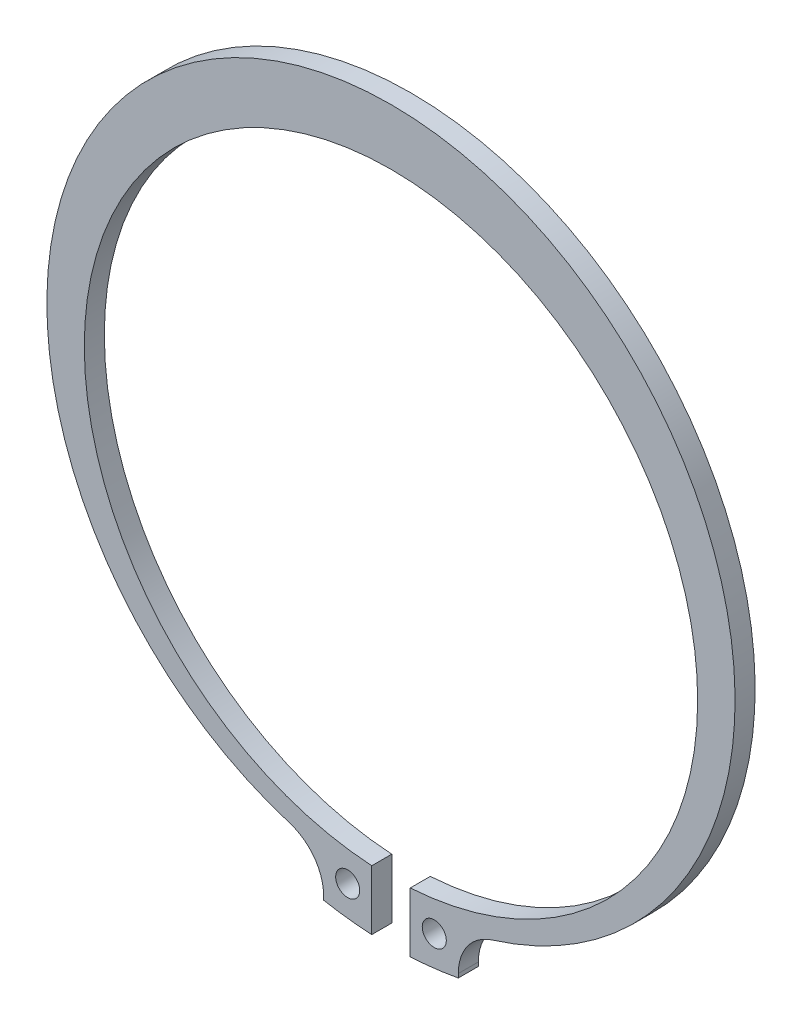
ISO-10303-21;
HEADER;
FILE_DESCRIPTION(('STEP AP214'),'2;1');
FILE_NAME('part.step','',(''),(''),'','','');
FILE_SCHEMA(('AUTOMOTIVE_DESIGN { 1 0 10303 214 1 1 1 1 }'));
ENDSEC;
DATA;
#1=APPLICATION_CONTEXT('core data for automotive mechanical design processes');
#2=APPLICATION_PROTOCOL_DEFINITION('international standard','automotive_design',2000,#1);
#3=PRODUCT_CONTEXT('',#1,'mechanical');
#4=PRODUCT('Part','Part','',(#3));
#5=PRODUCT_RELATED_PRODUCT_CATEGORY('part','',(#4));
#6=PRODUCT_DEFINITION_FORMATION('','',#4);
#7=PRODUCT_DEFINITION_CONTEXT('part definition',#1,'design');
#8=PRODUCT_DEFINITION('design','',#6,#7);
#9=PRODUCT_DEFINITION_SHAPE('','',#8);
#10=(LENGTH_UNIT() NAMED_UNIT(*) SI_UNIT(.MILLI.,.METRE.));
#11=(NAMED_UNIT(*) PLANE_ANGLE_UNIT() SI_UNIT($,.RADIAN.));
#12=(NAMED_UNIT(*) SI_UNIT($,.STERADIAN.) SOLID_ANGLE_UNIT());
#13=UNCERTAINTY_MEASURE_WITH_UNIT(LENGTH_MEASURE(1.E-05),#10,'distance_accuracy_value','');
#14=(GEOMETRIC_REPRESENTATION_CONTEXT(3) GLOBAL_UNCERTAINTY_ASSIGNED_CONTEXT((#13)) GLOBAL_UNIT_ASSIGNED_CONTEXT((#10,
#11,#12)) REPRESENTATION_CONTEXT('',''));
#15=CARTESIAN_POINT('',(0.,0.,0.));
#16=DIRECTION('',(0.,0.,1.));
#17=DIRECTION('',(1.,0.,0.));
#18=AXIS2_PLACEMENT_3D('',#15,#16,#17);
#19=CARTESIAN_POINT('',(10.8,-6.72639731257,0.));
#20=DIRECTION('',(1.,0.,0.));
#21=DIRECTION('',(0.,0.,-1.));
#22=AXIS2_PLACEMENT_3D('',#19,#20,#21);
#23=PLANE('',#22);
#24=DIRECTION('',(0.,0.,1.));
#25=VECTOR('',#24,1.);
#26=CARTESIAN_POINT('',(10.7999999999945,-6.72639731254067,0.));
#27=LINE('',#26,#25);
#28=CARTESIAN_POINT('',(10.7999999999972,-6.72639731254015,0.));
#29=VERTEX_POINT('',#28);
#30=CARTESIAN_POINT('',(10.7999999999972,-6.72639731254015,2.5));
#31=VERTEX_POINT('',#30);
#32=EDGE_CURVE('E96',#29,#31,#27,.T.);
#33=ORIENTED_EDGE('',*,*,#32,.F.);
#34=DIRECTION('',(0.,1.,0.));
#35=VECTOR('',#34,1.);
#36=CARTESIAN_POINT('',(10.8,0.,0.));
#37=LINE('',#36,#35);
#38=CARTESIAN_POINT('',(10.8,-6.24115564747,0.));
#39=VERTEX_POINT('',#38);
#40=EDGE_CURVE('E99',#29,#39,#37,.T.);
#41=ORIENTED_EDGE('',*,*,#40,.T.);
#42=DIRECTION('',(0.,0.,1.));
#43=VECTOR('',#42,1.);
#44=CARTESIAN_POINT('',(10.8,-6.24115564747,0.));
#45=LINE('',#44,#43);
#46=CARTESIAN_POINT('',(10.8,-6.24115564747,2.5));
#47=VERTEX_POINT('',#46);
#48=EDGE_CURVE('E119',#39,#47,#45,.T.);
#49=ORIENTED_EDGE('',*,*,#48,.T.);
#50=DIRECTION('',(0.,1.,0.));
#51=VECTOR('',#50,1.);
#52=CARTESIAN_POINT('',(10.8,-6.72639731257,2.5));
#53=LINE('',#52,#51);
#54=EDGE_CURVE('E101',#47,#31,#53,.F.);
#55=ORIENTED_EDGE('',*,*,#54,.T.);
#56=EDGE_LOOP('',(#33,#41,#49,#55));
#57=FACE_BOUND('',#56,.T.);
#58=ADVANCED_FACE('F17',(#57),#23,.T.);
#59=CARTESIAN_POINT('',(-6.,-6.24115564747,0.));
#60=DIRECTION('',(-1.,0.,0.));
#61=DIRECTION('',(0.,0.,1.));
#62=AXIS2_PLACEMENT_3D('',#59,#60,#61);
#63=PLANE('',#62);
#64=DIRECTION('',(0.,0.,1.));
#65=VECTOR('',#64,1.);
#66=CARTESIAN_POINT('',(-6.,-6.24115564747,0.));
#67=LINE('',#66,#65);
#68=CARTESIAN_POINT('',(-6.,-6.24115564747,2.5));
#69=VERTEX_POINT('',#68);
#70=CARTESIAN_POINT('',(-6.,-6.24115564747,0.));
#71=VERTEX_POINT('',#70);
#72=EDGE_CURVE('E175',#69,#71,#67,.F.);
#73=ORIENTED_EDGE('',*,*,#72,.T.);
#74=DIRECTION('',(0.,1.,0.));
#75=VECTOR('',#74,1.);
#76=CARTESIAN_POINT('',(-6.,0.,0.));
#77=LINE('',#76,#75);
#78=CARTESIAN_POINT('',(-5.99999999999725,-6.72639731254015,0.));
#79=VERTEX_POINT('',#78);
#80=EDGE_CURVE('E115',#71,#79,#77,.F.);
#81=ORIENTED_EDGE('',*,*,#80,.T.);
#82=DIRECTION('',(0.,0.,1.));
#83=VECTOR('',#82,1.);
#84=CARTESIAN_POINT('',(-5.9999999999945,-6.72639731254066,0.));
#85=LINE('',#84,#83);
#86=CARTESIAN_POINT('',(-5.99999999999725,-6.72639731254015,2.5));
#87=VERTEX_POINT('',#86);
#88=EDGE_CURVE('E162',#87,#79,#85,.F.);
#89=ORIENTED_EDGE('',*,*,#88,.F.);
#90=DIRECTION('',(0.,1.,0.));
#91=VECTOR('',#90,1.);
#92=CARTESIAN_POINT('',(-6.,-6.24115564747,2.5));
#93=LINE('',#92,#91);
#94=EDGE_CURVE('E116',#87,#69,#93,.T.);
#95=ORIENTED_EDGE('',*,*,#94,.T.);
#96=EDGE_LOOP('',(#73,#81,#89,#95));
#97=FACE_BOUND('',#96,.T.);
#98=ADVANCED_FACE('F211',(#97),#63,.T.);
#99=CARTESIAN_POINT('',(0.,0.,0.));
#100=DIRECTION('',(0.,0.,1.));
#101=DIRECTION('',(1.,0.,0.));
#102=AXIS2_PLACEMENT_3D('',#99,#100,#101);
#103=PLANE('',#102);
#104=CARTESIAN_POINT('',(7.8,-3.44148574169,0.));
#105=DIRECTION('',(0.,0.,-1.));
#106=DIRECTION('',(-1.,0.,0.));
#107=AXIS2_PLACEMENT_3D('',#104,#105,#106);
#108=CIRCLE('',#107,1.5);
#109=CARTESIAN_POINT('',(6.3,-3.44148574169,0.));
#110=VERTEX_POINT('',#109);
#111=EDGE_CURVE('E152',#110,#110,#108,.F.);
#112=ORIENTED_EDGE('',*,*,#111,.T.);
#113=EDGE_LOOP('',(#112));
#114=FACE_BOUND('',#113,.T.);
#115=CARTESIAN_POINT('',(-3.,-3.44148574169,0.));
#116=DIRECTION('',(0.,0.,1.));
#117=DIRECTION('',(1.,0.,0.));
#118=AXIS2_PLACEMENT_3D('',#115,#116,#117);
#119=CIRCLE('',#118,1.5);
#120=CARTESIAN_POINT('',(-1.5,-3.44148574169,0.));
#121=VERTEX_POINT('',#120);
#122=EDGE_CURVE('E155',#121,#121,#119,.T.);
#123=ORIENTED_EDGE('',*,*,#122,.T.);
#124=EDGE_LOOP('',(#123));
#125=FACE_BOUND('',#124,.T.);
#126=CARTESIAN_POINT('',(2.4,38.1746316289,0.));
#127=DIRECTION('',(0.,0.,1.));
#128=DIRECTION('',(1.,0.,0.));
#129=AXIS2_PLACEMENT_3D('',#126,#127,#128);
#130=CIRCLE('',#129,45.68);
#131=CARTESIAN_POINT('',(0.,-7.44227751673637,0.));
#132=VERTEX_POINT('',#131);
#133=EDGE_CURVE('E160',#79,#132,#130,.T.);
#134=ORIENTED_EDGE('',*,*,#133,.F.);
#135=ORIENTED_EDGE('',*,*,#80,.F.);
#136=CARTESIAN_POINT('',(-12.,-6.24115564747,0.));
#137=DIRECTION('',(0.,0.,1.));
#138=DIRECTION('',(1.,0.,0.));
#139=AXIS2_PLACEMENT_3D('',#136,#137,#138);
#140=CIRCLE('',#139,6.);
#141=CARTESIAN_POINT('',(-10.2337308347746,-0.507021603346691,0.));
#142=VERTEX_POINT('',#141);
#143=EDGE_CURVE('E163',#71,#142,#140,.T.);
#144=ORIENTED_EDGE('',*,*,#143,.T.);
#145=CARTESIAN_POINT('',(2.4,40.5079649622,0.));
#146=DIRECTION('',(0.,0.,1.));
#147=DIRECTION('',(1.,0.,0.));
#148=AXIS2_PLACEMENT_3D('',#145,#146,#147);
#149=CIRCLE('',#148,42.9166666667);
#150=CARTESIAN_POINT('',(15.03373083478,-0.507021603364115,0.));
#151=VERTEX_POINT('',#150);
#152=EDGE_CURVE('E166',#151,#142,#149,.T.);
#153=ORIENTED_EDGE('',*,*,#152,.F.);
#154=CARTESIAN_POINT('',(16.8,-6.24115564747,0.));
#155=DIRECTION('',(0.,0.,1.));
#156=DIRECTION('',(1.,0.,0.));
#157=AXIS2_PLACEMENT_3D('',#154,#155,#156);
#158=CIRCLE('',#157,6.);
#159=EDGE_CURVE('E113',#151,#39,#158,.T.);
#160=ORIENTED_EDGE('',*,*,#159,.T.);
#161=ORIENTED_EDGE('',*,*,#40,.F.);
#162=CARTESIAN_POINT('',(2.4,38.1746316289,0.));
#163=DIRECTION('',(0.,0.,1.));
#164=DIRECTION('',(1.,0.,0.));
#165=AXIS2_PLACEMENT_3D('',#162,#163,#164);
#166=CIRCLE('',#165,45.68);
#167=CARTESIAN_POINT('',(4.79999999999927,-7.44227751672278,0.));
#168=VERTEX_POINT('',#167);
#169=EDGE_CURVE('E20',#168,#29,#166,.T.);
#170=ORIENTED_EDGE('',*,*,#169,.F.);
#171=DIRECTION('',(0.,1.,0.));
#172=VECTOR('',#171,1.);
#173=CARTESIAN_POINT('',(4.8,0.,0.));
#174=LINE('',#173,#172);
#175=CARTESIAN_POINT('',(4.79999999999909,2.89213097914853E-11,0.));
#176=VERTEX_POINT('',#175);
#177=EDGE_CURVE('E91',#176,#168,#174,.F.);
#178=ORIENTED_EDGE('',*,*,#177,.F.);
#179=CARTESIAN_POINT('',(2.4,38.1746316289,0.));
#180=DIRECTION('',(0.,0.,1.));
#181=DIRECTION('',(1.,0.,0.));
#182=AXIS2_PLACEMENT_3D('',#179,#180,#181);
#183=CIRCLE('',#182,38.25);
#184=CARTESIAN_POINT('',(9.01188845769951E-13,2.89213097914853E-11,0.));
#185=VERTEX_POINT('',#184);
#186=EDGE_CURVE('E127',#176,#185,#183,.T.);
#187=ORIENTED_EDGE('',*,*,#186,.T.);
#188=DIRECTION('',(0.,1.,0.));
#189=VECTOR('',#188,1.);
#190=CARTESIAN_POINT('',(0.,-7.44227751675,0.));
#191=LINE('',#190,#189);
#192=EDGE_CURVE('E125',#132,#185,#191,.T.);
#193=ORIENTED_EDGE('',*,*,#192,.F.);
#194=EDGE_LOOP('',(#134,#135,#144,#153,#160,#161,#170,#178,#187,#193));
#195=FACE_BOUND('',#194,.T.);
#196=ADVANCED_FACE('F110',(#114,#125,#195),#103,.F.);
#197=CARTESIAN_POINT('',(4.8,0.,0.));
#198=DIRECTION('',(-1.,0.,0.));
#199=DIRECTION('',(0.,0.,1.));
#200=AXIS2_PLACEMENT_3D('',#197,#198,#199);
#201=PLANE('',#200);
#202=DIRECTION('',(0.,0.,1.));
#203=VECTOR('',#202,1.);
#204=CARTESIAN_POINT('',(4.79999999999818,2.88657986402541E-11,0.));
#205=LINE('',#204,#203);
#206=CARTESIAN_POINT('',(4.79999999999909,2.89213097914853E-11,2.5));
#207=VERTEX_POINT('',#206);
#208=EDGE_CURVE('E158',#207,#176,#205,.F.);
#209=ORIENTED_EDGE('',*,*,#208,.T.);
#210=ORIENTED_EDGE('',*,*,#177,.T.);
#211=DIRECTION('',(0.,0.,1.));
#212=VECTOR('',#211,1.);
#213=CARTESIAN_POINT('',(4.79999999999854,-7.44227751672281,0.));
#214=LINE('',#213,#212);
#215=CARTESIAN_POINT('',(4.79999999999927,-7.44227751672278,2.5));
#216=VERTEX_POINT('',#215);
#217=EDGE_CURVE('E106',#216,#168,#214,.F.);
#218=ORIENTED_EDGE('',*,*,#217,.F.);
#219=DIRECTION('',(0.,1.,0.));
#220=VECTOR('',#219,1.);
#221=CARTESIAN_POINT('',(4.8,0.,2.5));
#222=LINE('',#221,#220);
#223=EDGE_CURVE('E151',#207,#216,#222,.F.);
#224=ORIENTED_EDGE('',*,*,#223,.F.);
#225=EDGE_LOOP('',(#209,#210,#218,#224));
#226=FACE_BOUND('',#225,.T.);
#227=ADVANCED_FACE('F200',(#226),#201,.T.);
#228=CARTESIAN_POINT('',(2.4,38.1746316289,0.));
#229=DIRECTION('',(0.,0.,1.));
#230=DIRECTION('',(1.,0.,0.));
#231=AXIS2_PLACEMENT_3D('',#228,#229,#230);
#232=CYLINDRICAL_SURFACE('',#231,45.68);
#233=ORIENTED_EDGE('',*,*,#217,.T.);
#234=ORIENTED_EDGE('',*,*,#169,.T.);
#235=ORIENTED_EDGE('',*,*,#32,.T.);
#236=CARTESIAN_POINT('',(2.4,38.1746316289,2.5));
#237=DIRECTION('',(0.,0.,1.));
#238=DIRECTION('',(1.,0.,0.));
#239=AXIS2_PLACEMENT_3D('',#236,#237,#238);
#240=CIRCLE('',#239,45.68);
#241=EDGE_CURVE('E149',#216,#31,#240,.T.);
#242=ORIENTED_EDGE('',*,*,#241,.F.);
#243=EDGE_LOOP('',(#233,#234,#235,#242));
#244=FACE_BOUND('',#243,.T.);
#245=ADVANCED_FACE('F118',(#244),#232,.T.);
#246=CARTESIAN_POINT('',(16.8,-6.24115564747,0.));
#247=DIRECTION('',(0.,0.,1.));
#248=DIRECTION('',(1.,0.,0.));
#249=AXIS2_PLACEMENT_3D('',#246,#247,#248);
#250=CYLINDRICAL_SURFACE('',#249,6.);
#251=CARTESIAN_POINT('',(16.8,-6.24115564747,2.5));
#252=DIRECTION('',(0.,0.,1.));
#253=DIRECTION('',(1.,0.,0.));
#254=AXIS2_PLACEMENT_3D('',#251,#252,#253);
#255=CIRCLE('',#254,6.);
#256=CARTESIAN_POINT('',(15.0337308347853,-0.507021603381536,2.5));
#257=VERTEX_POINT('',#256);
#258=EDGE_CURVE('E146',#47,#257,#255,.F.);
#259=ORIENTED_EDGE('',*,*,#258,.F.);
#260=ORIENTED_EDGE('',*,*,#48,.F.);
#261=ORIENTED_EDGE('',*,*,#159,.F.);
#262=DIRECTION('',(0.,0.,1.));
#263=VECTOR('',#262,1.);
#264=CARTESIAN_POINT('',(15.033730834807,-0.507021603374846,0.));
#265=LINE('',#264,#263);
#266=EDGE_CURVE('E168',#257,#151,#265,.F.);
#267=ORIENTED_EDGE('',*,*,#266,.F.);
#268=EDGE_LOOP('',(#259,#260,#261,#267));
#269=FACE_BOUND('',#268,.T.);
#270=ADVANCED_FACE('F203',(#269),#250,.F.);
#271=CARTESIAN_POINT('',(2.4,40.5079649622,0.));
#272=DIRECTION('',(0.,0.,1.));
#273=DIRECTION('',(1.,0.,0.));
#274=AXIS2_PLACEMENT_3D('',#271,#272,#273);
#275=CYLINDRICAL_SURFACE('',#274,42.9166666667);
#276=ORIENTED_EDGE('',*,*,#266,.T.);
#277=ORIENTED_EDGE('',*,*,#152,.T.);
#278=DIRECTION('',(0.,0.,1.));
#279=VECTOR('',#278,1.);
#280=CARTESIAN_POINT('',(-10.2337308347963,-0.507021603340002,0.));
#281=LINE('',#280,#279);
#282=CARTESIAN_POINT('',(-10.2337308347746,-0.507021603346691,2.5));
#283=VERTEX_POINT('',#282);
#284=EDGE_CURVE('E165',#142,#283,#281,.T.);
#285=ORIENTED_EDGE('',*,*,#284,.T.);
#286=CARTESIAN_POINT('',(2.4,40.5079649622,2.5));
#287=DIRECTION('',(0.,0.,1.));
#288=DIRECTION('',(1.,0.,0.));
#289=AXIS2_PLACEMENT_3D('',#286,#287,#288);
#290=CIRCLE('',#289,42.9166666667);
#291=EDGE_CURVE('E143',#257,#283,#290,.T.);
#292=ORIENTED_EDGE('',*,*,#291,.F.);
#293=EDGE_LOOP('',(#276,#277,#285,#292));
#294=FACE_BOUND('',#293,.T.);
#295=ADVANCED_FACE('F204',(#294),#275,.T.);
#296=CARTESIAN_POINT('',(-12.,-6.24115564747,0.));
#297=DIRECTION('',(0.,0.,1.));
#298=DIRECTION('',(1.,0.,0.));
#299=AXIS2_PLACEMENT_3D('',#296,#297,#298);
#300=CYLINDRICAL_SURFACE('',#299,6.);
#301=CARTESIAN_POINT('',(-12.,-6.24115564747,2.5));
#302=DIRECTION('',(0.,0.,1.));
#303=DIRECTION('',(1.,0.,0.));
#304=AXIS2_PLACEMENT_3D('',#301,#302,#303);
#305=CIRCLE('',#304,6.);
#306=EDGE_CURVE('E140',#283,#69,#305,.F.);
#307=ORIENTED_EDGE('',*,*,#306,.F.);
#308=ORIENTED_EDGE('',*,*,#284,.F.);
#309=ORIENTED_EDGE('',*,*,#143,.F.);
#310=ORIENTED_EDGE('',*,*,#72,.F.);
#311=EDGE_LOOP('',(#307,#308,#309,#310));
#312=FACE_BOUND('',#311,.T.);
#313=ADVANCED_FACE('F208',(#312),#300,.F.);
#314=CARTESIAN_POINT('',(2.4,38.1746316289,0.));
#315=DIRECTION('',(0.,0.,1.));
#316=DIRECTION('',(1.,0.,0.));
#317=AXIS2_PLACEMENT_3D('',#314,#315,#316);
#318=CYLINDRICAL_SURFACE('',#317,45.68);
#319=ORIENTED_EDGE('',*,*,#88,.T.);
#320=ORIENTED_EDGE('',*,*,#133,.T.);
#321=DIRECTION('',(0.,0.,-1.));
#322=VECTOR('',#321,1.);
#323=CARTESIAN_POINT('',(0.,-7.44227751675,0.));
#324=LINE('',#323,#322);
#325=CARTESIAN_POINT('',(0.,-7.44227751673637,2.5));
#326=VERTEX_POINT('',#325);
#327=EDGE_CURVE('E128',#326,#132,#324,.T.);
#328=ORIENTED_EDGE('',*,*,#327,.F.);
#329=CARTESIAN_POINT('',(2.4,38.1746316289,2.5));
#330=DIRECTION('',(0.,0.,1.));
#331=DIRECTION('',(1.,0.,0.));
#332=AXIS2_PLACEMENT_3D('',#329,#330,#331);
#333=CIRCLE('',#332,45.68);
#334=EDGE_CURVE('E137',#87,#326,#333,.T.);
#335=ORIENTED_EDGE('',*,*,#334,.F.);
#336=EDGE_LOOP('',(#319,#320,#328,#335));
#337=FACE_BOUND('',#336,.T.);
#338=ADVANCED_FACE('F194',(#337),#318,.T.);
#339=CARTESIAN_POINT('',(0.,-7.44227751675,0.));
#340=DIRECTION('',(1.,0.,0.));
#341=DIRECTION('',(0.,0.,-1.));
#342=AXIS2_PLACEMENT_3D('',#339,#340,#341);
#343=PLANE('',#342);
#344=ORIENTED_EDGE('',*,*,#327,.T.);
#345=ORIENTED_EDGE('',*,*,#192,.T.);
#346=DIRECTION('',(0.,0.,1.));
#347=VECTOR('',#346,1.);
#348=CARTESIAN_POINT('',(1.8023776915399E-12,2.88657986402541E-11,0.));
#349=LINE('',#348,#347);
#350=CARTESIAN_POINT('',(9.01188845769951E-13,2.89213097914853E-11,2.5));
#351=VERTEX_POINT('',#350);
#352=EDGE_CURVE('E35',#185,#351,#349,.T.);
#353=ORIENTED_EDGE('',*,*,#352,.T.);
#354=DIRECTION('',(0.,1.,0.));
#355=VECTOR('',#354,1.);
#356=CARTESIAN_POINT('',(0.,0.,2.5));
#357=LINE('',#356,#355);
#358=EDGE_CURVE('E136',#326,#351,#357,.T.);
#359=ORIENTED_EDGE('',*,*,#358,.F.);
#360=EDGE_LOOP('',(#344,#345,#353,#359));
#361=FACE_BOUND('',#360,.T.);
#362=ADVANCED_FACE('F191',(#361),#343,.T.);
#363=CARTESIAN_POINT('',(2.4,38.1746316289,0.));
#364=DIRECTION('',(0.,0.,1.));
#365=DIRECTION('',(1.,0.,0.));
#366=AXIS2_PLACEMENT_3D('',#363,#364,#365);
#367=CYLINDRICAL_SURFACE('',#366,38.25);
#368=CARTESIAN_POINT('',(2.4,38.1746316289,2.5));
#369=DIRECTION('',(0.,0.,1.));
#370=DIRECTION('',(1.,0.,0.));
#371=AXIS2_PLACEMENT_3D('',#368,#369,#370);
#372=CIRCLE('',#371,38.25);
#373=EDGE_CURVE('E133',#351,#207,#372,.F.);
#374=ORIENTED_EDGE('',*,*,#373,.F.);
#375=ORIENTED_EDGE('',*,*,#352,.F.);
#376=ORIENTED_EDGE('',*,*,#186,.F.);
#377=ORIENTED_EDGE('',*,*,#208,.F.);
#378=EDGE_LOOP('',(#374,#375,#376,#377));
#379=FACE_BOUND('',#378,.T.);
#380=ADVANCED_FACE('F199',(#379),#367,.F.);
#381=CARTESIAN_POINT('',(-3.,-3.44148574169,2.5));
#382=DIRECTION('',(0.,0.,1.));
#383=DIRECTION('',(1.,0.,0.));
#384=AXIS2_PLACEMENT_3D('',#381,#382,#383);
#385=CYLINDRICAL_SURFACE('',#384,1.5);
#386=CARTESIAN_POINT('',(-3.,-3.44148574169,2.5));
#387=DIRECTION('',(0.,0.,1.));
#388=DIRECTION('',(1.,0.,0.));
#389=AXIS2_PLACEMENT_3D('',#386,#387,#388);
#390=CIRCLE('',#389,1.5);
#391=CARTESIAN_POINT('',(-1.5,-3.44148574169,2.5));
#392=VERTEX_POINT('',#391);
#393=EDGE_CURVE('E26',#392,#392,#390,.F.);
#394=ORIENTED_EDGE('',*,*,#393,.F.);
#395=EDGE_LOOP('',(#394));
#396=FACE_BOUND('',#395,.T.);
#397=ORIENTED_EDGE('',*,*,#122,.F.);
#398=EDGE_LOOP('',(#397));
#399=FACE_BOUND('',#398,.T.);
#400=ADVANCED_FACE('F227',(#396,#399),#385,.F.);
#401=CARTESIAN_POINT('',(7.8,-3.44148574169,2.5));
#402=DIRECTION('',(0.,0.,-1.));
#403=DIRECTION('',(-1.,0.,0.));
#404=AXIS2_PLACEMENT_3D('',#401,#402,#403);
#405=CYLINDRICAL_SURFACE('',#404,1.5);
#406=CARTESIAN_POINT('',(7.8,-3.44148574169,2.5));
#407=DIRECTION('',(0.,0.,-1.));
#408=DIRECTION('',(-1.,0.,0.));
#409=AXIS2_PLACEMENT_3D('',#406,#407,#408);
#410=CIRCLE('',#409,1.5);
#411=CARTESIAN_POINT('',(6.3,-3.44148574169,2.5));
#412=VERTEX_POINT('',#411);
#413=EDGE_CURVE('E11',#412,#412,#410,.T.);
#414=ORIENTED_EDGE('',*,*,#413,.F.);
#415=EDGE_LOOP('',(#414));
#416=FACE_BOUND('',#415,.T.);
#417=ORIENTED_EDGE('',*,*,#111,.F.);
#418=EDGE_LOOP('',(#417));
#419=FACE_BOUND('',#418,.T.);
#420=ADVANCED_FACE('F221',(#416,#419),#405,.F.);
#421=CARTESIAN_POINT('',(0.,0.,2.5));
#422=DIRECTION('',(0.,0.,1.));
#423=DIRECTION('',(1.,0.,0.));
#424=AXIS2_PLACEMENT_3D('',#421,#422,#423);
#425=PLANE('',#424);
#426=ORIENTED_EDGE('',*,*,#413,.T.);
#427=EDGE_LOOP('',(#426));
#428=FACE_BOUND('',#427,.T.);
#429=ORIENTED_EDGE('',*,*,#393,.T.);
#430=EDGE_LOOP('',(#429));
#431=FACE_BOUND('',#430,.T.);
#432=ORIENTED_EDGE('',*,*,#358,.T.);
#433=ORIENTED_EDGE('',*,*,#373,.T.);
#434=ORIENTED_EDGE('',*,*,#223,.T.);
#435=ORIENTED_EDGE('',*,*,#241,.T.);
#436=ORIENTED_EDGE('',*,*,#54,.F.);
#437=ORIENTED_EDGE('',*,*,#258,.T.);
#438=ORIENTED_EDGE('',*,*,#291,.T.);
#439=ORIENTED_EDGE('',*,*,#306,.T.);
#440=ORIENTED_EDGE('',*,*,#94,.F.);
#441=ORIENTED_EDGE('',*,*,#334,.T.);
#442=EDGE_LOOP('',(#432,#433,#434,#435,#436,#437,#438,#439,#440,#441));
#443=FACE_BOUND('',#442,.T.);
#444=ADVANCED_FACE('F189',(#428,#431,#443),#425,.T.);
#445=CLOSED_SHELL('',(#58,#98,#196,#227,#245,#270,#295,#313,#338,#362,#380,#400,#420,#444));
#446=MANIFOLD_SOLID_BREP('B1',#445);
#447=ADVANCED_BREP_SHAPE_REPRESENTATION('',(#18,#446),#14);
#448=SHAPE_DEFINITION_REPRESENTATION(#9,#447);
ENDSEC;
END-ISO-10303-21;
